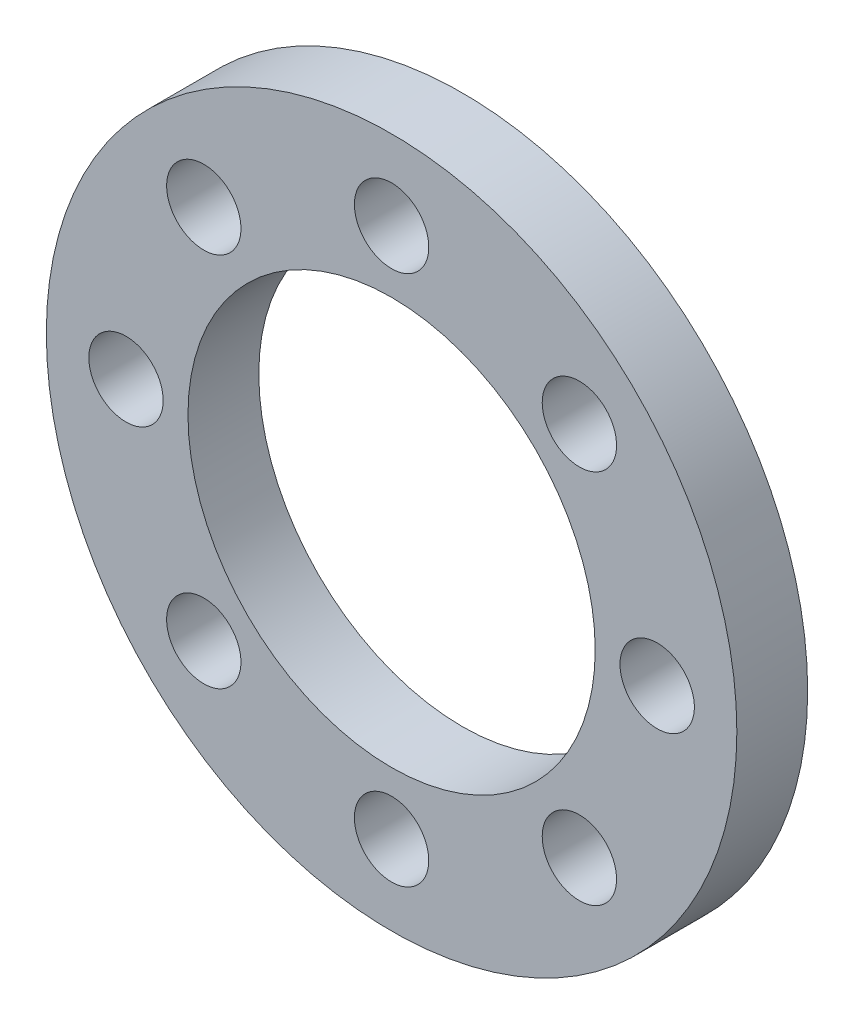
ISO-10303-21;
HEADER;
FILE_DESCRIPTION(('STEP AP214'),'2;1');
FILE_NAME('part.step','',(''),(''),'','','');
FILE_SCHEMA(('AUTOMOTIVE_DESIGN { 1 0 10303 214 1 1 1 1 }'));
ENDSEC;
DATA;
#1=APPLICATION_CONTEXT('core data for automotive mechanical design processes');
#2=APPLICATION_PROTOCOL_DEFINITION('international standard','automotive_design',2000,#1);
#3=PRODUCT_CONTEXT('',#1,'mechanical');
#4=PRODUCT('Part','Part','',(#3));
#5=PRODUCT_RELATED_PRODUCT_CATEGORY('part','',(#4));
#6=PRODUCT_DEFINITION_FORMATION('','',#4);
#7=PRODUCT_DEFINITION_CONTEXT('part definition',#1,'design');
#8=PRODUCT_DEFINITION('design','',#6,#7);
#9=PRODUCT_DEFINITION_SHAPE('','',#8);
#10=(LENGTH_UNIT() NAMED_UNIT(*) SI_UNIT(.MILLI.,.METRE.));
#11=(NAMED_UNIT(*) PLANE_ANGLE_UNIT() SI_UNIT($,.RADIAN.));
#12=(NAMED_UNIT(*) SI_UNIT($,.STERADIAN.) SOLID_ANGLE_UNIT());
#13=UNCERTAINTY_MEASURE_WITH_UNIT(LENGTH_MEASURE(1.E-05),#10,'distance_accuracy_value','');
#14=(GEOMETRIC_REPRESENTATION_CONTEXT(3) GLOBAL_UNCERTAINTY_ASSIGNED_CONTEXT((#13)) GLOBAL_UNIT_ASSIGNED_CONTEXT((#10,
#11,#12)) REPRESENTATION_CONTEXT('',''));
#15=CARTESIAN_POINT('',(0.,0.,0.));
#16=DIRECTION('',(0.,0.,1.));
#17=DIRECTION('',(1.,0.,0.));
#18=AXIS2_PLACEMENT_3D('',#15,#16,#17);
#19=CARTESIAN_POINT('',(0.,0.,2.));
#20=DIRECTION('',(0.,0.,1.));
#21=DIRECTION('',(1.,0.,0.));
#22=AXIS2_PLACEMENT_3D('',#19,#20,#21);
#23=PLANE('',#22);
#24=CARTESIAN_POINT('',(0.,7.5,2.));
#25=DIRECTION('',(0.,0.,-1.));
#26=DIRECTION('',(-1.,0.,0.));
#27=AXIS2_PLACEMENT_3D('',#24,#25,#26);
#28=CIRCLE('',#27,1.05);
#29=CARTESIAN_POINT('',(-1.05,7.5,2.));
#30=VERTEX_POINT('',#29);
#31=EDGE_CURVE('E57',#30,#30,#28,.T.);
#32=ORIENTED_EDGE('',*,*,#31,.T.);
#33=EDGE_LOOP('',(#32));
#34=FACE_BOUND('',#33,.T.);
#35=CARTESIAN_POINT('',(-5.3033008588992,5.30330085889933,2.));
#36=DIRECTION('',(0.,0.,-1.));
#37=DIRECTION('',(-1.,0.,0.));
#38=AXIS2_PLACEMENT_3D('',#35,#36,#37);
#39=CIRCLE('',#38,1.05000000000004);
#40=CARTESIAN_POINT('',(-6.35330085889924,5.30330085889933,2.));
#41=VERTEX_POINT('',#40);
#42=EDGE_CURVE('E113',#41,#41,#39,.T.);
#43=ORIENTED_EDGE('',*,*,#42,.T.);
#44=EDGE_LOOP('',(#43));
#45=FACE_BOUND('',#44,.T.);
#46=CARTESIAN_POINT('',(-7.50000000000032,3.18366503443004E-13,2.));
#47=DIRECTION('',(0.,0.,-1.));
#48=DIRECTION('',(-1.,0.,0.));
#49=AXIS2_PLACEMENT_3D('',#46,#47,#48);
#50=CIRCLE('',#49,1.05000000000024);
#51=CARTESIAN_POINT('',(-8.55000000000055,3.18366503443004E-13,2.));
#52=VERTEX_POINT('',#51);
#53=EDGE_CURVE('E105',#52,#52,#50,.T.);
#54=ORIENTED_EDGE('',*,*,#53,.T.);
#55=EDGE_LOOP('',(#54));
#56=FACE_BOUND('',#55,.T.);
#57=CARTESIAN_POINT('',(-5.30330085889965,-5.30330085889888,2.));
#58=DIRECTION('',(0.,0.,-1.));
#59=DIRECTION('',(-1.,0.,0.));
#60=AXIS2_PLACEMENT_3D('',#57,#58,#59);
#61=CIRCLE('',#60,1.05000000000049);
#62=CARTESIAN_POINT('',(-6.35330085890014,-5.30330085889888,2.));
#63=VERTEX_POINT('',#62);
#64=EDGE_CURVE('E97',#63,#63,#61,.T.);
#65=ORIENTED_EDGE('',*,*,#64,.T.);
#66=EDGE_LOOP('',(#65));
#67=FACE_BOUND('',#66,.T.);
#68=CARTESIAN_POINT('',(-6.36733006886009E-13,-7.5,2.));
#69=DIRECTION('',(0.,0.,-1.));
#70=DIRECTION('',(-1.,0.,0.));
#71=AXIS2_PLACEMENT_3D('',#68,#69,#70);
#72=CIRCLE('',#71,1.05000000000066);
#73=CARTESIAN_POINT('',(-1.0500000000013,-7.5,2.));
#74=VERTEX_POINT('',#73);
#75=EDGE_CURVE('E89',#74,#74,#72,.T.);
#76=ORIENTED_EDGE('',*,*,#75,.T.);
#77=EDGE_LOOP('',(#76));
#78=FACE_BOUND('',#77,.T.);
#79=CARTESIAN_POINT('',(5.30330085889856,-5.30330085889933,2.));
#80=DIRECTION('',(0.,0.,-1.));
#81=DIRECTION('',(-1.,0.,0.));
#82=AXIS2_PLACEMENT_3D('',#79,#80,#81);
#83=CIRCLE('',#82,1.05000000000065);
#84=CARTESIAN_POINT('',(4.25330085889791,-5.30330085889933,2.));
#85=VERTEX_POINT('',#84);
#86=EDGE_CURVE('E81',#85,#85,#83,.T.);
#87=ORIENTED_EDGE('',*,*,#86,.T.);
#88=EDGE_LOOP('',(#87));
#89=FACE_BOUND('',#88,.T.);
#90=CARTESIAN_POINT('',(7.49999999999968,-3.19284988542365E-13,2.));
#91=DIRECTION('',(0.,0.,-1.));
#92=DIRECTION('',(-1.,0.,0.));
#93=AXIS2_PLACEMENT_3D('',#90,#91,#92);
#94=CIRCLE('',#93,1.05000000000047);
#95=CARTESIAN_POINT('',(6.44999999999921,-3.19284988542365E-13,2.));
#96=VERTEX_POINT('',#95);
#97=EDGE_CURVE('E73',#96,#96,#94,.T.);
#98=ORIENTED_EDGE('',*,*,#97,.T.);
#99=EDGE_LOOP('',(#98));
#100=FACE_BOUND('',#99,.T.);
#101=CARTESIAN_POINT('',(5.30330085889902,5.30330085889888,2.));
#102=DIRECTION('',(0.,0.,-1.));
#103=DIRECTION('',(-1.,0.,0.));
#104=AXIS2_PLACEMENT_3D('',#101,#102,#103);
#105=CIRCLE('',#104,1.05000000000024);
#106=CARTESIAN_POINT('',(4.25330085889877,5.30330085889888,2.));
#107=VERTEX_POINT('',#106);
#108=EDGE_CURVE('E65',#107,#107,#105,.T.);
#109=ORIENTED_EDGE('',*,*,#108,.T.);
#110=EDGE_LOOP('',(#109));
#111=FACE_BOUND('',#110,.T.);
#112=CARTESIAN_POINT('',(0.,0.,2.));
#113=DIRECTION('',(0.,0.,1.));
#114=DIRECTION('',(1.,0.,0.));
#115=AXIS2_PLACEMENT_3D('',#112,#113,#114);
#116=CIRCLE('',#115,9.75);
#117=CARTESIAN_POINT('',(9.75,0.,2.));
#118=VERTEX_POINT('',#117);
#119=EDGE_CURVE('E10',#118,#118,#116,.T.);
#120=ORIENTED_EDGE('',*,*,#119,.T.);
#121=EDGE_LOOP('',(#120));
#122=FACE_BOUND('',#121,.T.);
#123=CARTESIAN_POINT('',(0.,0.,2.));
#124=DIRECTION('',(0.,0.,1.));
#125=DIRECTION('',(1.,0.,0.));
#126=AXIS2_PLACEMENT_3D('',#123,#124,#125);
#127=CIRCLE('',#126,5.75);
#128=CARTESIAN_POINT('',(5.75,0.,2.));
#129=VERTEX_POINT('',#128);
#130=EDGE_CURVE('E51',#129,#129,#127,.T.);
#131=ORIENTED_EDGE('',*,*,#130,.F.);
#132=EDGE_LOOP('',(#131));
#133=FACE_BOUND('',#132,.T.);
#134=ADVANCED_FACE('F38',(#34,#45,#56,#67,#78,#89,#100,#111,#122,#133),#23,.T.);
#135=CARTESIAN_POINT('',(0.,0.,0.));
#136=DIRECTION('',(0.,0.,1.));
#137=DIRECTION('',(1.,0.,0.));
#138=AXIS2_PLACEMENT_3D('',#135,#136,#137);
#139=PLANE('',#138);
#140=CARTESIAN_POINT('',(0.,7.5,0.));
#141=DIRECTION('',(0.,0.,-1.));
#142=DIRECTION('',(-1.,0.,0.));
#143=AXIS2_PLACEMENT_3D('',#140,#141,#142);
#144=CIRCLE('',#143,1.05);
#145=CARTESIAN_POINT('',(-1.05,7.5,0.));
#146=VERTEX_POINT('',#145);
#147=EDGE_CURVE('E117',#146,#146,#144,.T.);
#148=ORIENTED_EDGE('',*,*,#147,.F.);
#149=EDGE_LOOP('',(#148));
#150=FACE_BOUND('',#149,.T.);
#151=CARTESIAN_POINT('',(-5.3033008588992,5.30330085889933,0.));
#152=DIRECTION('',(0.,0.,-1.));
#153=DIRECTION('',(-1.,0.,0.));
#154=AXIS2_PLACEMENT_3D('',#151,#152,#153);
#155=CIRCLE('',#154,1.05000000000004);
#156=CARTESIAN_POINT('',(-6.35330085889924,5.30330085889933,0.));
#157=VERTEX_POINT('',#156);
#158=EDGE_CURVE('E109',#157,#157,#155,.T.);
#159=ORIENTED_EDGE('',*,*,#158,.F.);
#160=EDGE_LOOP('',(#159));
#161=FACE_BOUND('',#160,.T.);
#162=CARTESIAN_POINT('',(-7.50000000000032,3.18366503443004E-13,0.));
#163=DIRECTION('',(0.,0.,-1.));
#164=DIRECTION('',(-1.,0.,0.));
#165=AXIS2_PLACEMENT_3D('',#162,#163,#164);
#166=CIRCLE('',#165,1.05000000000024);
#167=CARTESIAN_POINT('',(-8.55000000000055,3.18366503443004E-13,0.));
#168=VERTEX_POINT('',#167);
#169=EDGE_CURVE('E101',#168,#168,#166,.T.);
#170=ORIENTED_EDGE('',*,*,#169,.F.);
#171=EDGE_LOOP('',(#170));
#172=FACE_BOUND('',#171,.T.);
#173=CARTESIAN_POINT('',(-5.30330085889965,-5.30330085889888,0.));
#174=DIRECTION('',(0.,0.,-1.));
#175=DIRECTION('',(-1.,0.,0.));
#176=AXIS2_PLACEMENT_3D('',#173,#174,#175);
#177=CIRCLE('',#176,1.05000000000049);
#178=CARTESIAN_POINT('',(-6.35330085890014,-5.30330085889888,0.));
#179=VERTEX_POINT('',#178);
#180=EDGE_CURVE('E93',#179,#179,#177,.T.);
#181=ORIENTED_EDGE('',*,*,#180,.F.);
#182=EDGE_LOOP('',(#181));
#183=FACE_BOUND('',#182,.T.);
#184=CARTESIAN_POINT('',(-6.36733006886009E-13,-7.5,0.));
#185=DIRECTION('',(0.,0.,-1.));
#186=DIRECTION('',(-1.,0.,0.));
#187=AXIS2_PLACEMENT_3D('',#184,#185,#186);
#188=CIRCLE('',#187,1.05000000000066);
#189=CARTESIAN_POINT('',(-1.0500000000013,-7.5,0.));
#190=VERTEX_POINT('',#189);
#191=EDGE_CURVE('E85',#190,#190,#188,.T.);
#192=ORIENTED_EDGE('',*,*,#191,.F.);
#193=EDGE_LOOP('',(#192));
#194=FACE_BOUND('',#193,.T.);
#195=CARTESIAN_POINT('',(5.30330085889856,-5.30330085889933,0.));
#196=DIRECTION('',(0.,0.,-1.));
#197=DIRECTION('',(-1.,0.,0.));
#198=AXIS2_PLACEMENT_3D('',#195,#196,#197);
#199=CIRCLE('',#198,1.05000000000065);
#200=CARTESIAN_POINT('',(4.25330085889791,-5.30330085889933,0.));
#201=VERTEX_POINT('',#200);
#202=EDGE_CURVE('E77',#201,#201,#199,.T.);
#203=ORIENTED_EDGE('',*,*,#202,.F.);
#204=EDGE_LOOP('',(#203));
#205=FACE_BOUND('',#204,.T.);
#206=CARTESIAN_POINT('',(7.49999999999968,-3.19284988542365E-13,0.));
#207=DIRECTION('',(0.,0.,-1.));
#208=DIRECTION('',(-1.,0.,0.));
#209=AXIS2_PLACEMENT_3D('',#206,#207,#208);
#210=CIRCLE('',#209,1.05000000000047);
#211=CARTESIAN_POINT('',(6.44999999999921,-3.19284988542365E-13,0.));
#212=VERTEX_POINT('',#211);
#213=EDGE_CURVE('E69',#212,#212,#210,.T.);
#214=ORIENTED_EDGE('',*,*,#213,.F.);
#215=EDGE_LOOP('',(#214));
#216=FACE_BOUND('',#215,.T.);
#217=CARTESIAN_POINT('',(5.30330085889902,5.30330085889888,0.));
#218=DIRECTION('',(0.,0.,-1.));
#219=DIRECTION('',(-1.,0.,0.));
#220=AXIS2_PLACEMENT_3D('',#217,#218,#219);
#221=CIRCLE('',#220,1.05000000000024);
#222=CARTESIAN_POINT('',(4.25330085889877,5.30330085889888,0.));
#223=VERTEX_POINT('',#222);
#224=EDGE_CURVE('E61',#223,#223,#221,.T.);
#225=ORIENTED_EDGE('',*,*,#224,.F.);
#226=EDGE_LOOP('',(#225));
#227=FACE_BOUND('',#226,.T.);
#228=CARTESIAN_POINT('',(0.,0.,0.));
#229=DIRECTION('',(0.,0.,1.));
#230=DIRECTION('',(1.,0.,0.));
#231=AXIS2_PLACEMENT_3D('',#228,#229,#230);
#232=CIRCLE('',#231,9.75);
#233=CARTESIAN_POINT('',(9.75,0.,0.));
#234=VERTEX_POINT('',#233);
#235=EDGE_CURVE('E42',#234,#234,#232,.T.);
#236=ORIENTED_EDGE('',*,*,#235,.F.);
#237=EDGE_LOOP('',(#236));
#238=FACE_BOUND('',#237,.T.);
#239=CARTESIAN_POINT('',(0.,0.,0.));
#240=DIRECTION('',(0.,0.,1.));
#241=DIRECTION('',(1.,0.,0.));
#242=AXIS2_PLACEMENT_3D('',#239,#240,#241);
#243=CIRCLE('',#242,5.75);
#244=CARTESIAN_POINT('',(5.75,0.,0.));
#245=VERTEX_POINT('',#244);
#246=EDGE_CURVE('E53',#245,#245,#243,.T.);
#247=ORIENTED_EDGE('',*,*,#246,.T.);
#248=EDGE_LOOP('',(#247));
#249=FACE_BOUND('',#248,.T.);
#250=ADVANCED_FACE('F134',(#150,#161,#172,#183,#194,#205,#216,#227,#238,#249),#139,.F.);
#251=CARTESIAN_POINT('',(0.,0.,2.));
#252=DIRECTION('',(0.,0.,-1.));
#253=DIRECTION('',(-1.,0.,0.));
#254=AXIS2_PLACEMENT_3D('',#251,#252,#253);
#255=CYLINDRICAL_SURFACE('',#254,9.75);
#256=ORIENTED_EDGE('',*,*,#119,.F.);
#257=EDGE_LOOP('',(#256));
#258=FACE_BOUND('',#257,.T.);
#259=ORIENTED_EDGE('',*,*,#235,.T.);
#260=EDGE_LOOP('',(#259));
#261=FACE_BOUND('',#260,.T.);
#262=ADVANCED_FACE('F40',(#258,#261),#255,.T.);
#263=CARTESIAN_POINT('',(0.,0.,2.));
#264=DIRECTION('',(0.,0.,-1.));
#265=DIRECTION('',(-1.,0.,0.));
#266=AXIS2_PLACEMENT_3D('',#263,#264,#265);
#267=CYLINDRICAL_SURFACE('',#266,5.75);
#268=ORIENTED_EDGE('',*,*,#130,.T.);
#269=EDGE_LOOP('',(#268));
#270=FACE_BOUND('',#269,.T.);
#271=ORIENTED_EDGE('',*,*,#246,.F.);
#272=EDGE_LOOP('',(#271));
#273=FACE_BOUND('',#272,.T.);
#274=ADVANCED_FACE('F155',(#270,#273),#267,.F.);
#275=CARTESIAN_POINT('',(5.30330085889902,5.30330085889888,2.));
#276=DIRECTION('',(0.,0.,-1.));
#277=DIRECTION('',(-1.,0.,0.));
#278=AXIS2_PLACEMENT_3D('',#275,#276,#277);
#279=CYLINDRICAL_SURFACE('',#278,1.05000000000024);
#280=ORIENTED_EDGE('',*,*,#108,.F.);
#281=EDGE_LOOP('',(#280));
#282=FACE_BOUND('',#281,.T.);
#283=ORIENTED_EDGE('',*,*,#224,.T.);
#284=EDGE_LOOP('',(#283));
#285=FACE_BOUND('',#284,.T.);
#286=ADVANCED_FACE('F157',(#282,#285),#279,.F.);
#287=CARTESIAN_POINT('',(7.49999999999968,-3.19284988542365E-13,2.));
#288=DIRECTION('',(0.,0.,-1.));
#289=DIRECTION('',(-1.,0.,0.));
#290=AXIS2_PLACEMENT_3D('',#287,#288,#289);
#291=CYLINDRICAL_SURFACE('',#290,1.05000000000047);
#292=ORIENTED_EDGE('',*,*,#97,.F.);
#293=EDGE_LOOP('',(#292));
#294=FACE_BOUND('',#293,.T.);
#295=ORIENTED_EDGE('',*,*,#213,.T.);
#296=EDGE_LOOP('',(#295));
#297=FACE_BOUND('',#296,.T.);
#298=ADVANCED_FACE('F164',(#294,#297),#291,.F.);
#299=CARTESIAN_POINT('',(5.30330085889856,-5.30330085889933,2.));
#300=DIRECTION('',(0.,0.,-1.));
#301=DIRECTION('',(-1.,0.,0.));
#302=AXIS2_PLACEMENT_3D('',#299,#300,#301);
#303=CYLINDRICAL_SURFACE('',#302,1.05000000000065);
#304=ORIENTED_EDGE('',*,*,#86,.F.);
#305=EDGE_LOOP('',(#304));
#306=FACE_BOUND('',#305,.T.);
#307=ORIENTED_EDGE('',*,*,#202,.T.);
#308=EDGE_LOOP('',(#307));
#309=FACE_BOUND('',#308,.T.);
#310=ADVANCED_FACE('F199',(#306,#309),#303,.F.);
#311=CARTESIAN_POINT('',(-6.36733006886009E-13,-7.5,2.));
#312=DIRECTION('',(0.,0.,-1.));
#313=DIRECTION('',(-1.,0.,0.));
#314=AXIS2_PLACEMENT_3D('',#311,#312,#313);
#315=CYLINDRICAL_SURFACE('',#314,1.05000000000066);
#316=ORIENTED_EDGE('',*,*,#75,.F.);
#317=EDGE_LOOP('',(#316));
#318=FACE_BOUND('',#317,.T.);
#319=ORIENTED_EDGE('',*,*,#191,.T.);
#320=EDGE_LOOP('',(#319));
#321=FACE_BOUND('',#320,.T.);
#322=ADVANCED_FACE('F208',(#318,#321),#315,.F.);
#323=CARTESIAN_POINT('',(-5.30330085889965,-5.30330085889888,2.));
#324=DIRECTION('',(0.,0.,-1.));
#325=DIRECTION('',(-1.,0.,0.));
#326=AXIS2_PLACEMENT_3D('',#323,#324,#325);
#327=CYLINDRICAL_SURFACE('',#326,1.05000000000049);
#328=ORIENTED_EDGE('',*,*,#64,.F.);
#329=EDGE_LOOP('',(#328));
#330=FACE_BOUND('',#329,.T.);
#331=ORIENTED_EDGE('',*,*,#180,.T.);
#332=EDGE_LOOP('',(#331));
#333=FACE_BOUND('',#332,.T.);
#334=ADVANCED_FACE('F217',(#330,#333),#327,.F.);
#335=CARTESIAN_POINT('',(-7.50000000000032,3.18366503443004E-13,2.));
#336=DIRECTION('',(0.,0.,-1.));
#337=DIRECTION('',(-1.,0.,0.));
#338=AXIS2_PLACEMENT_3D('',#335,#336,#337);
#339=CYLINDRICAL_SURFACE('',#338,1.05000000000024);
#340=ORIENTED_EDGE('',*,*,#53,.F.);
#341=EDGE_LOOP('',(#340));
#342=FACE_BOUND('',#341,.T.);
#343=ORIENTED_EDGE('',*,*,#169,.T.);
#344=EDGE_LOOP('',(#343));
#345=FACE_BOUND('',#344,.T.);
#346=ADVANCED_FACE('F226',(#342,#345),#339,.F.);
#347=CARTESIAN_POINT('',(-5.3033008588992,5.30330085889933,2.));
#348=DIRECTION('',(0.,0.,-1.));
#349=DIRECTION('',(-1.,0.,0.));
#350=AXIS2_PLACEMENT_3D('',#347,#348,#349);
#351=CYLINDRICAL_SURFACE('',#350,1.05000000000004);
#352=ORIENTED_EDGE('',*,*,#42,.F.);
#353=EDGE_LOOP('',(#352));
#354=FACE_BOUND('',#353,.T.);
#355=ORIENTED_EDGE('',*,*,#158,.T.);
#356=EDGE_LOOP('',(#355));
#357=FACE_BOUND('',#356,.T.);
#358=ADVANCED_FACE('F130',(#354,#357),#351,.F.);
#359=CARTESIAN_POINT('',(0.,7.5,2.));
#360=DIRECTION('',(0.,0.,-1.));
#361=DIRECTION('',(-1.,0.,0.));
#362=AXIS2_PLACEMENT_3D('',#359,#360,#361);
#363=CYLINDRICAL_SURFACE('',#362,1.05);
#364=ORIENTED_EDGE('',*,*,#31,.F.);
#365=EDGE_LOOP('',(#364));
#366=FACE_BOUND('',#365,.T.);
#367=ORIENTED_EDGE('',*,*,#147,.T.);
#368=EDGE_LOOP('',(#367));
#369=FACE_BOUND('',#368,.T.);
#370=ADVANCED_FACE('F127',(#366,#369),#363,.F.);
#371=CLOSED_SHELL('',(#134,#250,#262,#274,#286,#298,#310,#322,#334,#346,#358,#370));
#372=MANIFOLD_SOLID_BREP('B2',#371);
#373=ADVANCED_BREP_SHAPE_REPRESENTATION('',(#18,#372),#14);
#374=SHAPE_DEFINITION_REPRESENTATION(#9,#373);
ENDSEC;
END-ISO-10303-21;
